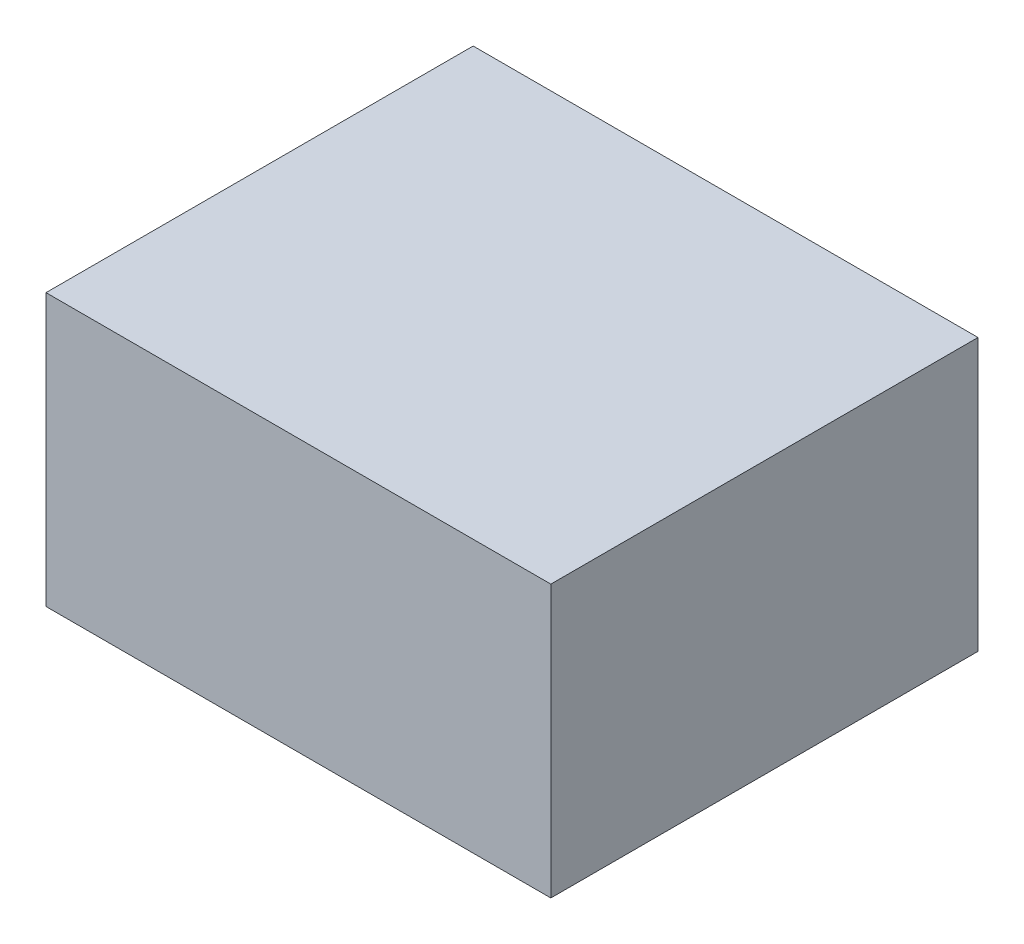
ISO-10303-21;
HEADER;
FILE_DESCRIPTION(('STEP AP214'),'2;1');
FILE_NAME('part.step','',(''),(''),'','','');
FILE_SCHEMA(('AUTOMOTIVE_DESIGN { 1 0 10303 214 1 1 1 1 }'));
ENDSEC;
DATA;
#1=APPLICATION_CONTEXT('core data for automotive mechanical design processes');
#2=APPLICATION_PROTOCOL_DEFINITION('international standard','automotive_design',2000,#1);
#3=PRODUCT_CONTEXT('',#1,'mechanical');
#4=PRODUCT('Part','Part','',(#3));
#5=PRODUCT_RELATED_PRODUCT_CATEGORY('part','',(#4));
#6=PRODUCT_DEFINITION_FORMATION('','',#4);
#7=PRODUCT_DEFINITION_CONTEXT('part definition',#1,'design');
#8=PRODUCT_DEFINITION('design','',#6,#7);
#9=PRODUCT_DEFINITION_SHAPE('','',#8);
#10=(LENGTH_UNIT() NAMED_UNIT(*) SI_UNIT(.MILLI.,.METRE.));
#11=(NAMED_UNIT(*) PLANE_ANGLE_UNIT() SI_UNIT($,.RADIAN.));
#12=(NAMED_UNIT(*) SI_UNIT($,.STERADIAN.) SOLID_ANGLE_UNIT());
#13=UNCERTAINTY_MEASURE_WITH_UNIT(LENGTH_MEASURE(1.E-05),#10,'distance_accuracy_value','');
#14=(GEOMETRIC_REPRESENTATION_CONTEXT(3) GLOBAL_UNCERTAINTY_ASSIGNED_CONTEXT((#13)) GLOBAL_UNIT_ASSIGNED_CONTEXT((#10,
#11,#12)) REPRESENTATION_CONTEXT('',''));
#15=CARTESIAN_POINT('',(0.,0.,0.));
#16=DIRECTION('',(0.,0.,1.));
#17=DIRECTION('',(1.,0.,0.));
#18=AXIS2_PLACEMENT_3D('',#15,#16,#17);
#19=CARTESIAN_POINT('',(-0.32500062,-0.17500092,0.));
#20=DIRECTION('',(0.,1.,0.));
#21=DIRECTION('',(0.,0.,1.));
#22=AXIS2_PLACEMENT_3D('',#19,#20,#21);
#23=PLANE('',#22);
#24=DIRECTION('',(0.,0.,1.));
#25=VECTOR('',#24,1.);
#26=CARTESIAN_POINT('',(0.32500062,-0.17500092,0.));
#27=LINE('',#26,#25);
#28=CARTESIAN_POINT('',(0.32500062,-0.17500092,0.));
#29=VERTEX_POINT('',#28);
#30=CARTESIAN_POINT('',(0.32500062,-0.17500092,0.5499989));
#31=VERTEX_POINT('',#30);
#32=EDGE_CURVE('E20',#29,#31,#27,.T.);
#33=ORIENTED_EDGE('',*,*,#32,.T.);
#34=DIRECTION('',(-1.,0.,0.));
#35=VECTOR('',#34,1.);
#36=CARTESIAN_POINT('',(0.32500062,-0.17500092,0.5499989));
#37=LINE('',#36,#35);
#38=CARTESIAN_POINT('',(-0.32500062,-0.17500092,0.5499989));
#39=VERTEX_POINT('',#38);
#40=EDGE_CURVE('E55',#31,#39,#37,.T.);
#41=ORIENTED_EDGE('',*,*,#40,.T.);
#42=DIRECTION('',(0.,0.,-1.));
#43=VECTOR('',#42,1.);
#44=CARTESIAN_POINT('',(-0.32500062,-0.17500092,0.));
#45=LINE('',#44,#43);
#46=CARTESIAN_POINT('',(-0.32500062,-0.17500092,0.));
#47=VERTEX_POINT('',#46);
#48=EDGE_CURVE('E76',#39,#47,#45,.T.);
#49=ORIENTED_EDGE('',*,*,#48,.T.);
#50=DIRECTION('',(-1.,0.,0.));
#51=VECTOR('',#50,1.);
#52=CARTESIAN_POINT('',(0.32500062,-0.17500092,0.));
#53=LINE('',#52,#51);
#54=EDGE_CURVE('E58',#29,#47,#53,.T.);
#55=ORIENTED_EDGE('',*,*,#54,.F.);
#56=EDGE_LOOP('',(#33,#41,#49,#55));
#57=FACE_BOUND('',#56,.T.);
#58=ADVANCED_FACE('F17',(#57),#23,.F.);
#59=CARTESIAN_POINT('',(0.32500062,-0.17500092,0.));
#60=DIRECTION('',(-1.,0.,0.));
#61=DIRECTION('',(0.,0.,1.));
#62=AXIS2_PLACEMENT_3D('',#59,#60,#61);
#63=PLANE('',#62);
#64=DIRECTION('',(0.,0.,-1.));
#65=VECTOR('',#64,1.);
#66=CARTESIAN_POINT('',(0.32500062,0.17500092,0.));
#67=LINE('',#66,#65);
#68=CARTESIAN_POINT('',(0.32500062,0.17500092,0.));
#69=VERTEX_POINT('',#68);
#70=CARTESIAN_POINT('',(0.32500062,0.17500092,0.5499989));
#71=VERTEX_POINT('',#70);
#72=EDGE_CURVE('E73',#69,#71,#67,.F.);
#73=ORIENTED_EDGE('',*,*,#72,.T.);
#74=DIRECTION('',(0.,1.,0.));
#75=VECTOR('',#74,1.);
#76=CARTESIAN_POINT('',(0.32500062,0.17500092,0.5499989));
#77=LINE('',#76,#75);
#78=EDGE_CURVE('E63',#71,#31,#77,.F.);
#79=ORIENTED_EDGE('',*,*,#78,.T.);
#80=ORIENTED_EDGE('',*,*,#32,.F.);
#81=DIRECTION('',(0.,1.,0.));
#82=VECTOR('',#81,1.);
#83=CARTESIAN_POINT('',(0.32500062,0.17500092,0.));
#84=LINE('',#83,#82);
#85=EDGE_CURVE('E78',#69,#29,#84,.F.);
#86=ORIENTED_EDGE('',*,*,#85,.F.);
#87=EDGE_LOOP('',(#73,#79,#80,#86));
#88=FACE_BOUND('',#87,.T.);
#89=ADVANCED_FACE('F72',(#88),#63,.F.);
#90=CARTESIAN_POINT('',(0.32500062,0.17500092,0.5499989));
#91=DIRECTION('',(0.,0.,-1.));
#92=DIRECTION('',(-1.,0.,0.));
#93=AXIS2_PLACEMENT_3D('',#90,#91,#92);
#94=PLANE('',#93);
#95=DIRECTION('',(0.,1.,0.));
#96=VECTOR('',#95,1.);
#97=CARTESIAN_POINT('',(-0.32500062,0.17500092,0.5499989));
#98=LINE('',#97,#96);
#99=CARTESIAN_POINT('',(-0.32500062,0.17500092,0.5499989));
#100=VERTEX_POINT('',#99);
#101=EDGE_CURVE('E69',#100,#39,#98,.F.);
#102=ORIENTED_EDGE('',*,*,#101,.T.);
#103=ORIENTED_EDGE('',*,*,#40,.F.);
#104=ORIENTED_EDGE('',*,*,#78,.F.);
#105=DIRECTION('',(1.,0.,0.));
#106=VECTOR('',#105,1.);
#107=CARTESIAN_POINT('',(0.32500062,0.17500092,0.5499989));
#108=LINE('',#107,#106);
#109=EDGE_CURVE('E83',#71,#100,#108,.F.);
#110=ORIENTED_EDGE('',*,*,#109,.T.);
#111=EDGE_LOOP('',(#102,#103,#104,#110));
#112=FACE_BOUND('',#111,.T.);
#113=ADVANCED_FACE('F66',(#112),#94,.F.);
#114=CARTESIAN_POINT('',(-0.32500062,0.17500092,0.));
#115=DIRECTION('',(1.,0.,0.));
#116=DIRECTION('',(0.,0.,-1.));
#117=AXIS2_PLACEMENT_3D('',#114,#115,#116);
#118=PLANE('',#117);
#119=ORIENTED_EDGE('',*,*,#48,.F.);
#120=ORIENTED_EDGE('',*,*,#101,.F.);
#121=DIRECTION('',(0.,0.,-1.));
#122=VECTOR('',#121,1.);
#123=CARTESIAN_POINT('',(-0.32500062,0.17500092,0.));
#124=LINE('',#123,#122);
#125=CARTESIAN_POINT('',(-0.32500062,0.17500092,0.));
#126=VERTEX_POINT('',#125);
#127=EDGE_CURVE('E26',#100,#126,#124,.T.);
#128=ORIENTED_EDGE('',*,*,#127,.T.);
#129=DIRECTION('',(0.,1.,0.));
#130=VECTOR('',#129,1.);
#131=CARTESIAN_POINT('',(-0.32500062,0.17500092,0.));
#132=LINE('',#131,#130);
#133=EDGE_CURVE('E34',#47,#126,#132,.T.);
#134=ORIENTED_EDGE('',*,*,#133,.F.);
#135=EDGE_LOOP('',(#119,#120,#128,#134));
#136=FACE_BOUND('',#135,.T.);
#137=ADVANCED_FACE('F88',(#136),#118,.F.);
#138=CARTESIAN_POINT('',(0.32500062,0.17500092,0.));
#139=DIRECTION('',(0.,0.,-1.));
#140=DIRECTION('',(-1.,0.,0.));
#141=AXIS2_PLACEMENT_3D('',#138,#139,#140);
#142=PLANE('',#141);
#143=ORIENTED_EDGE('',*,*,#133,.T.);
#144=DIRECTION('',(1.,0.,0.));
#145=VECTOR('',#144,1.);
#146=CARTESIAN_POINT('',(0.32500062,0.17500092,0.));
#147=LINE('',#146,#145);
#148=EDGE_CURVE('E11',#126,#69,#147,.T.);
#149=ORIENTED_EDGE('',*,*,#148,.T.);
#150=ORIENTED_EDGE('',*,*,#85,.T.);
#151=ORIENTED_EDGE('',*,*,#54,.T.);
#152=EDGE_LOOP('',(#143,#149,#150,#151));
#153=FACE_BOUND('',#152,.T.);
#154=ADVANCED_FACE('F91',(#153),#142,.T.);
#155=CARTESIAN_POINT('',(0.32500062,0.17500092,0.));
#156=DIRECTION('',(0.,-1.,0.));
#157=DIRECTION('',(0.,0.,-1.));
#158=AXIS2_PLACEMENT_3D('',#155,#156,#157);
#159=PLANE('',#158);
#160=ORIENTED_EDGE('',*,*,#127,.F.);
#161=ORIENTED_EDGE('',*,*,#109,.F.);
#162=ORIENTED_EDGE('',*,*,#72,.F.);
#163=ORIENTED_EDGE('',*,*,#148,.F.);
#164=EDGE_LOOP('',(#160,#161,#162,#163));
#165=FACE_BOUND('',#164,.T.);
#166=ADVANCED_FACE('F90',(#165),#159,.F.);
#167=CLOSED_SHELL('',(#58,#89,#113,#137,#154,#166));
#168=MANIFOLD_SOLID_BREP('B1',#167);
#169=ADVANCED_BREP_SHAPE_REPRESENTATION('',(#18,#168),#14);
#170=SHAPE_DEFINITION_REPRESENTATION(#9,#169);
ENDSEC;
END-ISO-10303-21;
